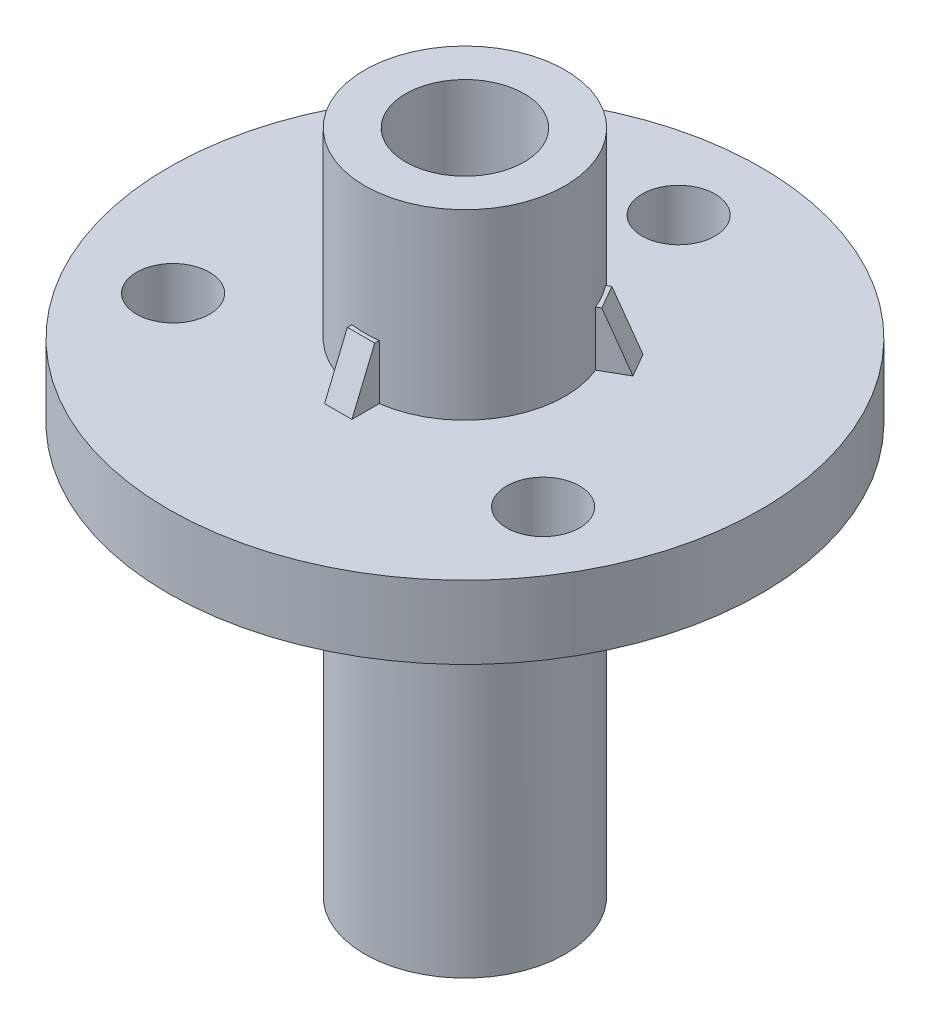
ISO-10303-21;
HEADER;
FILE_DESCRIPTION(('STEP AP214'),'2;1');
FILE_NAME('part.step','',(''),(''),'','','');
FILE_SCHEMA(('AUTOMOTIVE_DESIGN { 1 0 10303 214 1 1 1 1 }'));
ENDSEC;
DATA;
#1=APPLICATION_CONTEXT('core data for automotive mechanical design processes');
#2=APPLICATION_PROTOCOL_DEFINITION('international standard','automotive_design',2000,#1);
#3=PRODUCT_CONTEXT('',#1,'mechanical');
#4=PRODUCT('Part','Part','',(#3));
#5=PRODUCT_RELATED_PRODUCT_CATEGORY('part','',(#4));
#6=PRODUCT_DEFINITION_FORMATION('','',#4);
#7=PRODUCT_DEFINITION_CONTEXT('part definition',#1,'design');
#8=PRODUCT_DEFINITION('design','',#6,#7);
#9=PRODUCT_DEFINITION_SHAPE('','',#8);
#10=(LENGTH_UNIT() NAMED_UNIT(*) SI_UNIT(.MILLI.,.METRE.));
#11=(NAMED_UNIT(*) PLANE_ANGLE_UNIT() SI_UNIT($,.RADIAN.));
#12=(NAMED_UNIT(*) SI_UNIT($,.STERADIAN.) SOLID_ANGLE_UNIT());
#13=UNCERTAINTY_MEASURE_WITH_UNIT(LENGTH_MEASURE(1.E-05),#10,'distance_accuracy_value','');
#14=(GEOMETRIC_REPRESENTATION_CONTEXT(3) GLOBAL_UNCERTAINTY_ASSIGNED_CONTEXT((#13)) GLOBAL_UNIT_ASSIGNED_CONTEXT((#10,
#11,#12)) REPRESENTATION_CONTEXT('',''));
#15=CARTESIAN_POINT('',(0.,0.,0.));
#16=DIRECTION('',(0.,0.,1.));
#17=DIRECTION('',(1.,0.,0.));
#18=AXIS2_PLACEMENT_3D('',#15,#16,#17);
#19=CARTESIAN_POINT('',(0.,2.032,0.));
#20=DIRECTION('',(0.,1.,0.));
#21=DIRECTION('',(0.,0.,1.));
#22=AXIS2_PLACEMENT_3D('',#19,#20,#21);
#23=PLANE('',#22);
#24=CARTESIAN_POINT('',(10.3111149638085,2.032,5.9531249999999));
#25=DIRECTION('',(0.,1.,0.));
#26=DIRECTION('',(-0.866025403784443,0.,-0.499999999999992));
#27=AXIS2_PLACEMENT_3D('',#24,#25,#26);
#28=CIRCLE('',#27,2.032);
#29=CARTESIAN_POINT('',(8.55135134331854,2.032,4.93712499999992));
#30=VERTEX_POINT('',#29);
#31=EDGE_CURVE('E254',#30,#30,#28,.T.);
#32=ORIENTED_EDGE('',*,*,#31,.F.);
#33=EDGE_LOOP('',(#32));
#34=FACE_BOUND('',#33,.T.);
#35=CARTESIAN_POINT('',(-10.3111149638084,2.032,5.95312500000005));
#36=DIRECTION('',(0.,1.,0.));
#37=DIRECTION('',(0.866025403784436,0.,-0.500000000000004));
#38=AXIS2_PLACEMENT_3D('',#35,#36,#37);
#39=CIRCLE('',#38,2.032);
#40=CARTESIAN_POINT('',(-8.55135134331847,2.032,4.93712500000004));
#41=VERTEX_POINT('',#40);
#42=EDGE_CURVE('E245',#41,#41,#39,.T.);
#43=ORIENTED_EDGE('',*,*,#42,.F.);
#44=EDGE_LOOP('',(#43));
#45=FACE_BOUND('',#44,.T.);
#46=CARTESIAN_POINT('',(0.,2.032,-11.90625));
#47=DIRECTION('',(0.,1.,0.));
#48=DIRECTION('',(0.,0.,1.));
#49=AXIS2_PLACEMENT_3D('',#46,#47,#48);
#50=CIRCLE('',#49,2.032);
#51=CARTESIAN_POINT('',(0.,2.032,-9.87425));
#52=VERTEX_POINT('',#51);
#53=EDGE_CURVE('E242',#52,#52,#50,.T.);
#54=ORIENTED_EDGE('',*,*,#53,.F.);
#55=EDGE_LOOP('',(#54));
#56=FACE_BOUND('',#55,.T.);
#57=CARTESIAN_POINT('',(0.,2.032,0.));
#58=DIRECTION('',(0.,1.,0.));
#59=DIRECTION('',(0.,0.,1.));
#60=AXIS2_PLACEMENT_3D('',#57,#58,#59);
#61=CIRCLE('',#60,16.51);
#62=CARTESIAN_POINT('',(0.,2.032,16.51));
#63=VERTEX_POINT('',#62);
#64=EDGE_CURVE('E208',#63,#63,#61,.T.);
#65=ORIENTED_EDGE('',*,*,#64,.T.);
#66=EDGE_LOOP('',(#65));
#67=FACE_BOUND('',#66,.T.);
#68=CARTESIAN_POINT('',(0.,2.032,0.));
#69=DIRECTION('',(0.,1.,0.));
#70=DIRECTION('',(0.,0.,1.));
#71=AXIS2_PLACEMENT_3D('',#68,#69,#70);
#72=CIRCLE('',#71,5.588);
#73=CARTESIAN_POINT('',(4.41314486639695,2.032,-3.42781218683204));
#74=VERTEX_POINT('',#73);
#75=CARTESIAN_POINT('',(-4.41314486639691,2.032,-3.42781218683209));
#76=VERTEX_POINT('',#75);
#77=EDGE_CURVE('E207',#74,#76,#72,.T.);
#78=ORIENTED_EDGE('',*,*,#77,.F.);
#79=DIRECTION('',(0.866025403784443,0.,-0.499999999999993));
#80=VECTOR('',#79,1.);
#81=CARTESIAN_POINT('',(-0.380999999999991,2.032,-0.659911357683739));
#82=LINE('',#81,#80);
#83=CARTESIAN_POINT('',(5.73296758176445,2.032,-4.18981218683202));
#84=VERTEX_POINT('',#83);
#85=EDGE_CURVE('E158',#74,#84,#82,.T.);
#86=ORIENTED_EDGE('',*,*,#85,.T.);
#87=DIRECTION('',(0.499999999999992,0.,0.866025403784443));
#88=VECTOR('',#87,1.);
#89=CARTESIAN_POINT('',(6.11396758176444,2.032,-3.52990082914827));
#90=LINE('',#89,#88);
#91=CARTESIAN_POINT('',(6.49496758176444,2.032,-2.86998947146453));
#92=VERTEX_POINT('',#91);
#93=EDGE_CURVE('E144',#84,#92,#90,.T.);
#94=ORIENTED_EDGE('',*,*,#93,.T.);
#95=DIRECTION('',(-0.866025403784443,0.,0.499999999999993));
#96=VECTOR('',#95,1.);
#97=CARTESIAN_POINT('',(0.380999999999998,2.032,0.659911357683751));
#98=LINE('',#97,#96);
#99=CARTESIAN_POINT('',(5.17514486639695,2.032,-2.10798947146454));
#100=VERTEX_POINT('',#99);
#101=EDGE_CURVE('E156',#92,#100,#98,.T.);
#102=ORIENTED_EDGE('',*,*,#101,.T.);
#103=CARTESIAN_POINT('',(0.762,2.032,5.53580165829666));
#104=VERTEX_POINT('',#103);
#105=EDGE_CURVE('E130',#104,#100,#72,.T.);
#106=ORIENTED_EDGE('',*,*,#105,.F.);
#107=DIRECTION('',(0.,0.,1.));
#108=VECTOR('',#107,1.);
#109=CARTESIAN_POINT('',(0.761999999999993,2.032,0.));
#110=LINE('',#109,#108);
#111=CARTESIAN_POINT('',(0.762000000000001,2.032,7.05980165829666));
#112=VERTEX_POINT('',#111);
#113=EDGE_CURVE('E189',#104,#112,#110,.T.);
#114=ORIENTED_EDGE('',*,*,#113,.T.);
#115=DIRECTION('',(-1.,0.,0.));
#116=VECTOR('',#115,1.);
#117=CARTESIAN_POINT('',(0.,2.032,7.05980165829666));
#118=LINE('',#117,#116);
#119=CARTESIAN_POINT('',(-0.761999999999999,2.032,7.05980165829666));
#120=VERTEX_POINT('',#119);
#121=EDGE_CURVE('E219',#112,#120,#118,.T.);
#122=ORIENTED_EDGE('',*,*,#121,.T.);
#123=DIRECTION('',(0.,0.,-1.));
#124=VECTOR('',#123,1.);
#125=CARTESIAN_POINT('',(-0.762000000000007,2.032,0.));
#126=LINE('',#125,#124);
#127=CARTESIAN_POINT('',(-0.762000000000001,2.032,5.53580165829666));
#128=VERTEX_POINT('',#127);
#129=EDGE_CURVE('E186',#120,#128,#126,.T.);
#130=ORIENTED_EDGE('',*,*,#129,.T.);
#131=CARTESIAN_POINT('',(-5.17514486639692,2.032,-2.10798947146461));
#132=VERTEX_POINT('',#131);
#133=EDGE_CURVE('E201',#132,#128,#72,.T.);
#134=ORIENTED_EDGE('',*,*,#133,.F.);
#135=DIRECTION('',(-0.866025403784437,0.,-0.500000000000003));
#136=VECTOR('',#135,1.);
#137=CARTESIAN_POINT('',(-0.380999999999999,2.032,0.659911357683735));
#138=LINE('',#137,#136);
#139=CARTESIAN_POINT('',(-6.4949675817644,2.032,-2.86998947146462));
#140=VERTEX_POINT('',#139);
#141=EDGE_CURVE('E174',#132,#140,#138,.T.);
#142=ORIENTED_EDGE('',*,*,#141,.T.);
#143=DIRECTION('',(0.500000000000004,0.,-0.866025403784436));
#144=VECTOR('',#143,1.);
#145=CARTESIAN_POINT('',(-6.1139675817644,2.032,-3.52990082914836));
#146=LINE('',#145,#144);
#147=CARTESIAN_POINT('',(-5.73296758176439,2.032,-4.1898121868321));
#148=VERTEX_POINT('',#147);
#149=EDGE_CURVE('E145',#140,#148,#146,.T.);
#150=ORIENTED_EDGE('',*,*,#149,.T.);
#151=DIRECTION('',(0.866025403784437,0.,0.500000000000003));
#152=VECTOR('',#151,1.);
#153=CARTESIAN_POINT('',(0.381000000000006,2.032,-0.659911357683747));
#154=LINE('',#153,#152);
#155=EDGE_CURVE('E171',#148,#76,#154,.T.);
#156=ORIENTED_EDGE('',*,*,#155,.T.);
#157=EDGE_LOOP('',(#78,#86,#94,#102,#106,#114,#122,#130,#134,#142,#150,#156));
#158=FACE_BOUND('',#157,.T.);
#159=ADVANCED_FACE('F32',(#34,#45,#56,#67,#158),#23,.T.);
#160=CARTESIAN_POINT('',(0.,12.192,0.));
#161=DIRECTION('',(0.,-1.,0.));
#162=DIRECTION('',(0.,0.,-1.));
#163=AXIS2_PLACEMENT_3D('',#160,#161,#162);
#164=CYLINDRICAL_SURFACE('',#163,5.588);
#165=CARTESIAN_POINT('',(0.,12.192,0.));
#166=DIRECTION('',(0.,1.,0.));
#167=DIRECTION('',(0.,0.,1.));
#168=AXIS2_PLACEMENT_3D('',#165,#166,#167);
#169=CIRCLE('',#168,5.588);
#170=CARTESIAN_POINT('',(0.,12.192,5.588));
#171=VERTEX_POINT('',#170);
#172=EDGE_CURVE('E202',#171,#171,#169,.T.);
#173=ORIENTED_EDGE('',*,*,#172,.F.);
#174=EDGE_LOOP('',(#173));
#175=FACE_BOUND('',#174,.T.);
#176=DIRECTION('',(0.,-1.,0.));
#177=VECTOR('',#176,1.);
#178=CARTESIAN_POINT('',(4.41314486639696,5.08,-3.42781218683203));
#179=LINE('',#178,#177);
#180=CARTESIAN_POINT('',(4.41314486639695,5.08,-3.42781218683204));
#181=VERTEX_POINT('',#180);
#182=EDGE_CURVE('E134',#181,#74,#179,.T.);
#183=ORIENTED_EDGE('',*,*,#182,.T.);
#184=ORIENTED_EDGE('',*,*,#77,.T.);
#185=DIRECTION('',(0.,-1.,0.));
#186=VECTOR('',#185,1.);
#187=CARTESIAN_POINT('',(-4.41314486639691,5.08,-3.42781218683209));
#188=LINE('',#187,#186);
#189=CARTESIAN_POINT('',(-4.41314486639691,5.08,-3.42781218683209));
#190=VERTEX_POINT('',#189);
#191=EDGE_CURVE('E166',#190,#76,#188,.T.);
#192=ORIENTED_EDGE('',*,*,#191,.F.);
#193=CARTESIAN_POINT('',(0.,5.08,0.));
#194=DIRECTION('',(0.,-1.,0.));
#195=DIRECTION('',(0.,0.,-1.));
#196=AXIS2_PLACEMENT_3D('',#193,#194,#195);
#197=CIRCLE('',#196,5.588);
#198=CARTESIAN_POINT('',(-5.17514486639691,5.08,-2.10798947146462));
#199=VERTEX_POINT('',#198);
#200=EDGE_CURVE('E221',#199,#190,#197,.T.);
#201=ORIENTED_EDGE('',*,*,#200,.F.);
#202=DIRECTION('',(0.,-1.,0.));
#203=VECTOR('',#202,1.);
#204=CARTESIAN_POINT('',(-5.17514486639692,5.08,-2.10798947146461));
#205=LINE('',#204,#203);
#206=EDGE_CURVE('E169',#199,#132,#205,.T.);
#207=ORIENTED_EDGE('',*,*,#206,.T.);
#208=ORIENTED_EDGE('',*,*,#133,.T.);
#209=DIRECTION('',(0.,-1.,0.));
#210=VECTOR('',#209,1.);
#211=CARTESIAN_POINT('',(-0.762000000000001,5.08,5.53580165829666));
#212=LINE('',#211,#210);
#213=CARTESIAN_POINT('',(-0.762000000000001,5.08,5.53580165829666));
#214=VERTEX_POINT('',#213);
#215=EDGE_CURVE('E181',#214,#128,#212,.T.);
#216=ORIENTED_EDGE('',*,*,#215,.F.);
#217=CARTESIAN_POINT('',(0.,5.08,0.));
#218=DIRECTION('',(0.,-1.,0.));
#219=DIRECTION('',(0.,0.,-1.));
#220=AXIS2_PLACEMENT_3D('',#217,#218,#219);
#221=CIRCLE('',#220,5.588);
#222=CARTESIAN_POINT('',(0.762000000000004,5.08,5.53580165829665));
#223=VERTEX_POINT('',#222);
#224=EDGE_CURVE('E216',#223,#214,#221,.T.);
#225=ORIENTED_EDGE('',*,*,#224,.F.);
#226=DIRECTION('',(0.,-1.,0.));
#227=VECTOR('',#226,1.);
#228=CARTESIAN_POINT('',(0.761999999999999,5.08,5.53580165829666));
#229=LINE('',#228,#227);
#230=EDGE_CURVE('E184',#223,#104,#229,.T.);
#231=ORIENTED_EDGE('',*,*,#230,.T.);
#232=ORIENTED_EDGE('',*,*,#105,.T.);
#233=DIRECTION('',(0.,-1.,0.));
#234=VECTOR('',#233,1.);
#235=CARTESIAN_POINT('',(5.17514486639695,5.08,-2.10798947146454));
#236=LINE('',#235,#234);
#237=CARTESIAN_POINT('',(5.17514486639695,5.08,-2.10798947146454));
#238=VERTEX_POINT('',#237);
#239=EDGE_CURVE('E124',#238,#100,#236,.T.);
#240=ORIENTED_EDGE('',*,*,#239,.F.);
#241=CARTESIAN_POINT('',(0.,5.08,0.));
#242=DIRECTION('',(0.,-1.,0.));
#243=DIRECTION('',(0.,0.,-1.));
#244=AXIS2_PLACEMENT_3D('',#241,#242,#243);
#245=CIRCLE('',#244,5.588);
#246=EDGE_CURVE('E127',#181,#238,#245,.T.);
#247=ORIENTED_EDGE('',*,*,#246,.F.);
#248=EDGE_LOOP('',(#183,#184,#192,#201,#207,#208,#216,#225,#231,#232,#240,#247));
#249=FACE_BOUND('',#248,.T.);
#250=ADVANCED_FACE('F126',(#175,#249),#164,.T.);
#251=CARTESIAN_POINT('',(0.,-2.032,0.));
#252=DIRECTION('',(0.,1.,0.));
#253=DIRECTION('',(0.,0.,1.));
#254=AXIS2_PLACEMENT_3D('',#251,#252,#253);
#255=PLANE('',#254);
#256=CARTESIAN_POINT('',(10.3111149638085,-2.032,5.9531249999999));
#257=DIRECTION('',(0.,1.,0.));
#258=DIRECTION('',(0.,0.,1.));
#259=AXIS2_PLACEMENT_3D('',#256,#257,#258);
#260=CIRCLE('',#259,2.032);
#261=CARTESIAN_POINT('',(10.3111149638085,-2.032,7.98512499999991));
#262=VERTEX_POINT('',#261);
#263=EDGE_CURVE('E36',#262,#262,#260,.T.);
#264=ORIENTED_EDGE('',*,*,#263,.T.);
#265=EDGE_LOOP('',(#264));
#266=FACE_BOUND('',#265,.T.);
#267=CARTESIAN_POINT('',(-10.3111149638084,-2.032,5.95312500000005));
#268=DIRECTION('',(0.,1.,0.));
#269=DIRECTION('',(0.,0.,1.));
#270=AXIS2_PLACEMENT_3D('',#267,#268,#269);
#271=CIRCLE('',#270,2.032);
#272=CARTESIAN_POINT('',(-10.3111149638084,-2.032,7.98512500000005));
#273=VERTEX_POINT('',#272);
#274=EDGE_CURVE('E243',#273,#273,#271,.T.);
#275=ORIENTED_EDGE('',*,*,#274,.T.);
#276=EDGE_LOOP('',(#275));
#277=FACE_BOUND('',#276,.T.);
#278=CARTESIAN_POINT('',(0.,-2.032,-11.90625));
#279=DIRECTION('',(0.,1.,0.));
#280=DIRECTION('',(0.,0.,1.));
#281=AXIS2_PLACEMENT_3D('',#278,#279,#280);
#282=CIRCLE('',#281,2.032);
#283=CARTESIAN_POINT('',(0.,-2.032,-9.87425));
#284=VERTEX_POINT('',#283);
#285=EDGE_CURVE('E151',#284,#284,#282,.T.);
#286=ORIENTED_EDGE('',*,*,#285,.T.);
#287=EDGE_LOOP('',(#286));
#288=FACE_BOUND('',#287,.T.);
#289=CARTESIAN_POINT('',(0.,-2.032,0.));
#290=DIRECTION('',(0.,1.,0.));
#291=DIRECTION('',(0.,0.,1.));
#292=AXIS2_PLACEMENT_3D('',#289,#290,#291);
#293=CIRCLE('',#292,16.51);
#294=CARTESIAN_POINT('',(0.,-2.032,16.51));
#295=VERTEX_POINT('',#294);
#296=EDGE_CURVE('E205',#295,#295,#293,.T.);
#297=ORIENTED_EDGE('',*,*,#296,.F.);
#298=EDGE_LOOP('',(#297));
#299=FACE_BOUND('',#298,.T.);
#300=CARTESIAN_POINT('',(0.,-2.032,0.));
#301=DIRECTION('',(0.,1.,0.));
#302=DIRECTION('',(0.,0.,1.));
#303=AXIS2_PLACEMENT_3D('',#300,#301,#302);
#304=CIRCLE('',#303,5.588);
#305=CARTESIAN_POINT('',(0.,-2.032,5.588));
#306=VERTEX_POINT('',#305);
#307=EDGE_CURVE('E211',#306,#306,#304,.F.);
#308=ORIENTED_EDGE('',*,*,#307,.F.);
#309=EDGE_LOOP('',(#308));
#310=FACE_BOUND('',#309,.T.);
#311=ADVANCED_FACE('F339',(#266,#277,#288,#299,#310),#255,.F.);
#312=CARTESIAN_POINT('',(0.,2.032,0.));
#313=DIRECTION('',(0.,-1.,0.));
#314=DIRECTION('',(0.,0.,-1.));
#315=AXIS2_PLACEMENT_3D('',#312,#313,#314);
#316=CYLINDRICAL_SURFACE('',#315,16.51);
#317=ORIENTED_EDGE('',*,*,#64,.F.);
#318=EDGE_LOOP('',(#317));
#319=FACE_BOUND('',#318,.T.);
#320=ORIENTED_EDGE('',*,*,#296,.T.);
#321=EDGE_LOOP('',(#320));
#322=FACE_BOUND('',#321,.T.);
#323=ADVANCED_FACE('F336',(#319,#322),#316,.T.);
#324=CARTESIAN_POINT('',(0.,12.192,0.));
#325=DIRECTION('',(0.,1.,0.));
#326=DIRECTION('',(0.,0.,1.));
#327=AXIS2_PLACEMENT_3D('',#324,#325,#326);
#328=PLANE('',#327);
#329=CARTESIAN_POINT('',(0.,12.192,0.));
#330=DIRECTION('',(0.,1.,0.));
#331=DIRECTION('',(0.,0.,1.));
#332=AXIS2_PLACEMENT_3D('',#329,#330,#331);
#333=CIRCLE('',#332,3.302);
#334=CARTESIAN_POINT('',(0.,12.192,3.302));
#335=VERTEX_POINT('',#334);
#336=EDGE_CURVE('E192',#335,#335,#333,.T.);
#337=ORIENTED_EDGE('',*,*,#336,.F.);
#338=EDGE_LOOP('',(#337));
#339=FACE_BOUND('',#338,.T.);
#340=ORIENTED_EDGE('',*,*,#172,.T.);
#341=EDGE_LOOP('',(#340));
#342=FACE_BOUND('',#341,.T.);
#343=ADVANCED_FACE('F332',(#339,#342),#328,.T.);
#344=CARTESIAN_POINT('',(0.,-24.892,0.));
#345=DIRECTION('',(0.,1.,0.));
#346=DIRECTION('',(0.,0.,1.));
#347=AXIS2_PLACEMENT_3D('',#344,#345,#346);
#348=CYLINDRICAL_SURFACE('',#347,5.588);
#349=CARTESIAN_POINT('',(0.,-24.892,0.));
#350=DIRECTION('',(0.,-1.,0.));
#351=DIRECTION('',(0.,0.,-1.));
#352=AXIS2_PLACEMENT_3D('',#349,#350,#351);
#353=CIRCLE('',#352,5.588);
#354=CARTESIAN_POINT('',(0.,-24.892,-5.588));
#355=VERTEX_POINT('',#354);
#356=EDGE_CURVE('E196',#355,#355,#353,.T.);
#357=ORIENTED_EDGE('',*,*,#356,.F.);
#358=EDGE_LOOP('',(#357));
#359=FACE_BOUND('',#358,.T.);
#360=ORIENTED_EDGE('',*,*,#307,.T.);
#361=EDGE_LOOP('',(#360));
#362=FACE_BOUND('',#361,.T.);
#363=ADVANCED_FACE('F328',(#359,#362),#348,.T.);
#364=CARTESIAN_POINT('',(0.,-24.892,0.));
#365=DIRECTION('',(0.,-1.,0.));
#366=DIRECTION('',(0.,0.,-1.));
#367=AXIS2_PLACEMENT_3D('',#364,#365,#366);
#368=PLANE('',#367);
#369=CARTESIAN_POINT('',(0.,-24.892,0.));
#370=DIRECTION('',(0.,1.,0.));
#371=DIRECTION('',(0.,0.,1.));
#372=AXIS2_PLACEMENT_3D('',#369,#370,#371);
#373=CIRCLE('',#372,3.302);
#374=CARTESIAN_POINT('',(0.,-24.892,3.302));
#375=VERTEX_POINT('',#374);
#376=EDGE_CURVE('E193',#375,#375,#373,.T.);
#377=ORIENTED_EDGE('',*,*,#376,.T.);
#378=EDGE_LOOP('',(#377));
#379=FACE_BOUND('',#378,.T.);
#380=ORIENTED_EDGE('',*,*,#356,.T.);
#381=EDGE_LOOP('',(#380));
#382=FACE_BOUND('',#381,.T.);
#383=ADVANCED_FACE('F324',(#379,#382),#368,.T.);
#384=CARTESIAN_POINT('',(0.,-24.892,0.));
#385=DIRECTION('',(0.,1.,0.));
#386=DIRECTION('',(0.,0.,1.));
#387=AXIS2_PLACEMENT_3D('',#384,#385,#386);
#388=CYLINDRICAL_SURFACE('',#387,3.302);
#389=ORIENTED_EDGE('',*,*,#376,.F.);
#390=EDGE_LOOP('',(#389));
#391=FACE_BOUND('',#390,.T.);
#392=ORIENTED_EDGE('',*,*,#336,.T.);
#393=EDGE_LOOP('',(#392));
#394=FACE_BOUND('',#393,.T.);
#395=ADVANCED_FACE('F317',(#391,#394),#388,.F.);
#396=CARTESIAN_POINT('',(0.761999999999999,5.08,5.53580165829666));
#397=DIRECTION('',(0.,-1.,0.));
#398=DIRECTION('',(0.,0.,-1.));
#399=AXIS2_PLACEMENT_3D('',#396,#397,#398);
#400=PLANE('',#399);
#401=DIRECTION('',(0.,0.,1.));
#402=VECTOR('',#401,1.);
#403=CARTESIAN_POINT('',(-0.761999999999999,5.08,7.05980165829666));
#404=LINE('',#403,#402);
#405=CARTESIAN_POINT('',(-0.762000000000001,5.08,5.78980165829666));
#406=VERTEX_POINT('',#405);
#407=EDGE_CURVE('E179',#214,#406,#404,.T.);
#408=ORIENTED_EDGE('',*,*,#407,.T.);
#409=DIRECTION('',(1.,0.,0.));
#410=VECTOR('',#409,1.);
#411=CARTESIAN_POINT('',(0.761999999999999,5.08,5.78980165829666));
#412=LINE('',#411,#410);
#413=CARTESIAN_POINT('',(0.761999999999999,5.08,5.78980165829666));
#414=VERTEX_POINT('',#413);
#415=EDGE_CURVE('E238',#406,#414,#412,.T.);
#416=ORIENTED_EDGE('',*,*,#415,.T.);
#417=DIRECTION('',(0.,0.,-1.));
#418=VECTOR('',#417,1.);
#419=CARTESIAN_POINT('',(0.762000000000001,5.08,7.05980165829666));
#420=LINE('',#419,#418);
#421=EDGE_CURVE('E177',#414,#223,#420,.T.);
#422=ORIENTED_EDGE('',*,*,#421,.T.);
#423=ORIENTED_EDGE('',*,*,#224,.T.);
#424=EDGE_LOOP('',(#408,#416,#422,#423));
#425=FACE_BOUND('',#424,.T.);
#426=ADVANCED_FACE('F285',(#425),#400,.F.);
#427=CARTESIAN_POINT('',(0.762000000000001,5.08,7.05980165829666));
#428=DIRECTION('',(-1.,0.,0.));
#429=DIRECTION('',(0.,0.,1.));
#430=AXIS2_PLACEMENT_3D('',#427,#428,#429);
#431=PLANE('',#430);
#432=ORIENTED_EDGE('',*,*,#421,.F.);
#433=DIRECTION('',(0.,0.923076923076924,-0.384615384615382));
#434=VECTOR('',#433,1.);
#435=CARTESIAN_POINT('',(0.761999999999999,5.08,5.78980165829666));
#436=LINE('',#435,#434);
#437=EDGE_CURVE('E41',#414,#112,#436,.F.);
#438=ORIENTED_EDGE('',*,*,#437,.T.);
#439=ORIENTED_EDGE('',*,*,#113,.F.);
#440=ORIENTED_EDGE('',*,*,#230,.F.);
#441=EDGE_LOOP('',(#432,#438,#439,#440));
#442=FACE_BOUND('',#441,.T.);
#443=ADVANCED_FACE('F282',(#442),#431,.F.);
#444=CARTESIAN_POINT('',(-0.761999999999999,5.08,7.05980165829666));
#445=DIRECTION('',(1.,0.,0.));
#446=DIRECTION('',(0.,0.,-1.));
#447=AXIS2_PLACEMENT_3D('',#444,#445,#446);
#448=PLANE('',#447);
#449=ORIENTED_EDGE('',*,*,#129,.F.);
#450=DIRECTION('',(0.,-0.923076923076924,0.384615384615382));
#451=VECTOR('',#450,1.);
#452=CARTESIAN_POINT('',(-0.762000000000001,5.08,5.78980165829666));
#453=LINE('',#452,#451);
#454=EDGE_CURVE('E11',#120,#406,#453,.F.);
#455=ORIENTED_EDGE('',*,*,#454,.T.);
#456=ORIENTED_EDGE('',*,*,#407,.F.);
#457=ORIENTED_EDGE('',*,*,#215,.T.);
#458=EDGE_LOOP('',(#449,#455,#456,#457));
#459=FACE_BOUND('',#458,.T.);
#460=ADVANCED_FACE('F287',(#459),#448,.F.);
#461=CARTESIAN_POINT('',(-5.17514486639692,5.08,-2.10798947146461));
#462=DIRECTION('',(0.,-1.,0.));
#463=DIRECTION('',(0.866025403784436,0.,0.500000000000004));
#464=AXIS2_PLACEMENT_3D('',#461,#462,#463);
#465=PLANE('',#464);
#466=DIRECTION('',(-0.866025403784437,0.,-0.500000000000003));
#467=VECTOR('',#466,1.);
#468=CARTESIAN_POINT('',(-5.73296758176439,5.08,-4.1898121868321));
#469=LINE('',#468,#467);
#470=CARTESIAN_POINT('',(-4.63311531895815,5.08,-3.55481218683209));
#471=VERTEX_POINT('',#470);
#472=EDGE_CURVE('E163',#190,#471,#469,.T.);
#473=ORIENTED_EDGE('',*,*,#472,.T.);
#474=DIRECTION('',(-0.500000000000004,0.,0.866025403784436));
#475=VECTOR('',#474,1.);
#476=CARTESIAN_POINT('',(-5.39511531895815,5.08,-2.23498947146461));
#477=LINE('',#476,#475);
#478=CARTESIAN_POINT('',(-5.39511531895815,5.08,-2.23498947146461));
#479=VERTEX_POINT('',#478);
#480=EDGE_CURVE('E231',#471,#479,#477,.T.);
#481=ORIENTED_EDGE('',*,*,#480,.T.);
#482=DIRECTION('',(0.866025403784437,0.,0.500000000000003));
#483=VECTOR('',#482,1.);
#484=CARTESIAN_POINT('',(-6.4949675817644,5.08,-2.86998947146462));
#485=LINE('',#484,#483);
#486=EDGE_CURVE('E161',#479,#199,#485,.T.);
#487=ORIENTED_EDGE('',*,*,#486,.T.);
#488=ORIENTED_EDGE('',*,*,#200,.T.);
#489=EDGE_LOOP('',(#473,#481,#487,#488));
#490=FACE_BOUND('',#489,.T.);
#491=ADVANCED_FACE('F299',(#490),#465,.F.);
#492=CARTESIAN_POINT('',(-6.4949675817644,5.08,-2.86998947146462));
#493=DIRECTION('',(0.500000000000003,0.,-0.866025403784437));
#494=DIRECTION('',(-0.866025403784437,0.,-0.500000000000003));
#495=AXIS2_PLACEMENT_3D('',#492,#493,#494);
#496=PLANE('',#495);
#497=ORIENTED_EDGE('',*,*,#486,.F.);
#498=DIRECTION('',(0.333086693763243,0.923076923076924,0.192307692307692));
#499=VECTOR('',#498,1.);
#500=CARTESIAN_POINT('',(-5.39511531895815,5.08,-2.23498947146461));
#501=LINE('',#500,#499);
#502=EDGE_CURVE('E234',#479,#140,#501,.F.);
#503=ORIENTED_EDGE('',*,*,#502,.T.);
#504=ORIENTED_EDGE('',*,*,#141,.F.);
#505=ORIENTED_EDGE('',*,*,#206,.F.);
#506=EDGE_LOOP('',(#497,#503,#504,#505));
#507=FACE_BOUND('',#506,.T.);
#508=ADVANCED_FACE('F293',(#507),#496,.F.);
#509=CARTESIAN_POINT('',(-5.73296758176439,5.08,-4.1898121868321));
#510=DIRECTION('',(-0.500000000000003,0.,0.866025403784437));
#511=DIRECTION('',(0.866025403784437,0.,0.500000000000003));
#512=AXIS2_PLACEMENT_3D('',#509,#510,#511);
#513=PLANE('',#512);
#514=ORIENTED_EDGE('',*,*,#155,.F.);
#515=DIRECTION('',(-0.333086693763243,-0.923076923076924,-0.192307692307692));
#516=VECTOR('',#515,1.);
#517=CARTESIAN_POINT('',(-4.63311531895815,5.08,-3.55481218683209));
#518=LINE('',#517,#516);
#519=EDGE_CURVE('E236',#148,#471,#518,.F.);
#520=ORIENTED_EDGE('',*,*,#519,.T.);
#521=ORIENTED_EDGE('',*,*,#472,.F.);
#522=ORIENTED_EDGE('',*,*,#191,.T.);
#523=EDGE_LOOP('',(#514,#520,#521,#522));
#524=FACE_BOUND('',#523,.T.);
#525=ADVANCED_FACE('F303',(#524),#513,.F.);
#526=CARTESIAN_POINT('',(4.41314486639696,5.08,-3.42781218683203));
#527=DIRECTION('',(0.,-1.,0.));
#528=DIRECTION('',(-0.866025403784443,0.,0.499999999999992));
#529=AXIS2_PLACEMENT_3D('',#526,#527,#528);
#530=PLANE('',#529);
#531=DIRECTION('',(0.866025403784443,0.,-0.499999999999993));
#532=VECTOR('',#531,1.);
#533=CARTESIAN_POINT('',(6.49496758176444,5.08,-2.86998947146453));
#534=LINE('',#533,#532);
#535=CARTESIAN_POINT('',(5.39511531895819,5.08,-2.23498947146453));
#536=VERTEX_POINT('',#535);
#537=EDGE_CURVE('E135',#238,#536,#534,.T.);
#538=ORIENTED_EDGE('',*,*,#537,.T.);
#539=DIRECTION('',(-0.499999999999992,0.,-0.866025403784443));
#540=VECTOR('',#539,1.);
#541=CARTESIAN_POINT('',(4.6331153189582,5.08,-3.55481218683202));
#542=LINE('',#541,#540);
#543=CARTESIAN_POINT('',(4.6331153189582,5.08,-3.55481218683203));
#544=VERTEX_POINT('',#543);
#545=EDGE_CURVE('E226',#536,#544,#542,.T.);
#546=ORIENTED_EDGE('',*,*,#545,.T.);
#547=DIRECTION('',(-0.866025403784443,0.,0.499999999999993));
#548=VECTOR('',#547,1.);
#549=CARTESIAN_POINT('',(5.73296758176445,5.08,-4.18981218683202));
#550=LINE('',#549,#548);
#551=EDGE_CURVE('E143',#544,#181,#550,.T.);
#552=ORIENTED_EDGE('',*,*,#551,.T.);
#553=ORIENTED_EDGE('',*,*,#246,.T.);
#554=EDGE_LOOP('',(#538,#546,#552,#553));
#555=FACE_BOUND('',#554,.T.);
#556=ADVANCED_FACE('F139',(#555),#530,.F.);
#557=CARTESIAN_POINT('',(5.73296758176445,5.08,-4.18981218683202));
#558=DIRECTION('',(0.499999999999993,0.,0.866025403784443));
#559=DIRECTION('',(0.866025403784443,0.,-0.499999999999993));
#560=AXIS2_PLACEMENT_3D('',#557,#558,#559);
#561=PLANE('',#560);
#562=ORIENTED_EDGE('',*,*,#551,.F.);
#563=DIRECTION('',(-0.333086693763245,0.923076923076924,0.192307692307688));
#564=VECTOR('',#563,1.);
#565=CARTESIAN_POINT('',(4.6331153189582,5.08,-3.55481218683203));
#566=LINE('',#565,#564);
#567=EDGE_CURVE('E228',#544,#84,#566,.F.);
#568=ORIENTED_EDGE('',*,*,#567,.T.);
#569=ORIENTED_EDGE('',*,*,#85,.F.);
#570=ORIENTED_EDGE('',*,*,#182,.F.);
#571=EDGE_LOOP('',(#562,#568,#569,#570));
#572=FACE_BOUND('',#571,.T.);
#573=ADVANCED_FACE('F275',(#572),#561,.F.);
#574=CARTESIAN_POINT('',(6.49496758176444,5.08,-2.86998947146453));
#575=DIRECTION('',(-0.499999999999993,0.,-0.866025403784443));
#576=DIRECTION('',(-0.866025403784443,0.,0.499999999999993));
#577=AXIS2_PLACEMENT_3D('',#574,#575,#576);
#578=PLANE('',#577);
#579=ORIENTED_EDGE('',*,*,#101,.F.);
#580=DIRECTION('',(0.333086693763245,-0.923076923076924,-0.192307692307688));
#581=VECTOR('',#580,1.);
#582=CARTESIAN_POINT('',(5.39511531895819,5.08,-2.23498947146453));
#583=LINE('',#582,#581);
#584=EDGE_CURVE('E149',#92,#536,#583,.F.);
#585=ORIENTED_EDGE('',*,*,#584,.T.);
#586=ORIENTED_EDGE('',*,*,#537,.F.);
#587=ORIENTED_EDGE('',*,*,#239,.T.);
#588=EDGE_LOOP('',(#579,#585,#586,#587));
#589=FACE_BOUND('',#588,.T.);
#590=ADVANCED_FACE('F147',(#589),#578,.F.);
#591=CARTESIAN_POINT('',(4.63311531895821,5.08,-3.55481218683202));
#592=DIRECTION('',(-0.799408065031795,-0.384615384615382,0.461538461538455));
#593=DIRECTION('',(0.499999999999992,0.,0.866025403784443));
#594=AXIS2_PLACEMENT_3D('',#591,#592,#593);
#595=PLANE('',#594);
#596=ORIENTED_EDGE('',*,*,#584,.F.);
#597=ORIENTED_EDGE('',*,*,#93,.F.);
#598=ORIENTED_EDGE('',*,*,#567,.F.);
#599=ORIENTED_EDGE('',*,*,#545,.F.);
#600=EDGE_LOOP('',(#596,#597,#598,#599));
#601=FACE_BOUND('',#600,.T.);
#602=ADVANCED_FACE('F277',(#601),#595,.F.);
#603=CARTESIAN_POINT('',(-5.39511531895815,5.08,-2.23498947146461));
#604=DIRECTION('',(0.799408065031788,-0.384615384615383,0.461538461538466));
#605=DIRECTION('',(0.500000000000004,0.,-0.866025403784436));
#606=AXIS2_PLACEMENT_3D('',#603,#604,#605);
#607=PLANE('',#606);
#608=ORIENTED_EDGE('',*,*,#519,.F.);
#609=ORIENTED_EDGE('',*,*,#149,.F.);
#610=ORIENTED_EDGE('',*,*,#502,.F.);
#611=ORIENTED_EDGE('',*,*,#480,.F.);
#612=EDGE_LOOP('',(#608,#609,#610,#611));
#613=FACE_BOUND('',#612,.T.);
#614=ADVANCED_FACE('F297',(#613),#607,.F.);
#615=CARTESIAN_POINT('',(0.761999999999999,5.08,5.78980165829666));
#616=DIRECTION('',(0.,-0.384615384615382,-0.923076923076924));
#617=DIRECTION('',(0.,0.923076923076924,-0.384615384615382));
#618=AXIS2_PLACEMENT_3D('',#615,#616,#617);
#619=PLANE('',#618);
#620=ORIENTED_EDGE('',*,*,#454,.F.);
#621=ORIENTED_EDGE('',*,*,#121,.F.);
#622=ORIENTED_EDGE('',*,*,#437,.F.);
#623=ORIENTED_EDGE('',*,*,#415,.F.);
#624=EDGE_LOOP('',(#620,#621,#622,#623));
#625=FACE_BOUND('',#624,.T.);
#626=ADVANCED_FACE('F34',(#625),#619,.F.);
#627=CARTESIAN_POINT('',(0.,-24.892,-11.90625));
#628=DIRECTION('',(0.,1.,0.));
#629=DIRECTION('',(0.,0.,1.));
#630=AXIS2_PLACEMENT_3D('',#627,#628,#629);
#631=CYLINDRICAL_SURFACE('',#630,2.032);
#632=ORIENTED_EDGE('',*,*,#53,.T.);
#633=EDGE_LOOP('',(#632));
#634=FACE_BOUND('',#633,.T.);
#635=ORIENTED_EDGE('',*,*,#285,.F.);
#636=EDGE_LOOP('',(#635));
#637=FACE_BOUND('',#636,.T.);
#638=ADVANCED_FACE('F353',(#634,#637),#631,.F.);
#639=CARTESIAN_POINT('',(-10.3111149638084,-24.892,5.95312500000005));
#640=DIRECTION('',(0.,1.,0.));
#641=DIRECTION('',(0.,0.,1.));
#642=AXIS2_PLACEMENT_3D('',#639,#640,#641);
#643=CYLINDRICAL_SURFACE('',#642,2.032);
#644=ORIENTED_EDGE('',*,*,#42,.T.);
#645=EDGE_LOOP('',(#644));
#646=FACE_BOUND('',#645,.T.);
#647=ORIENTED_EDGE('',*,*,#274,.F.);
#648=EDGE_LOOP('',(#647));
#649=FACE_BOUND('',#648,.T.);
#650=ADVANCED_FACE('F357',(#646,#649),#643,.F.);
#651=CARTESIAN_POINT('',(10.3111149638085,-24.892,5.9531249999999));
#652=DIRECTION('',(0.,1.,0.));
#653=DIRECTION('',(0.,0.,1.));
#654=AXIS2_PLACEMENT_3D('',#651,#652,#653);
#655=CYLINDRICAL_SURFACE('',#654,2.032);
#656=ORIENTED_EDGE('',*,*,#31,.T.);
#657=EDGE_LOOP('',(#656));
#658=FACE_BOUND('',#657,.T.);
#659=ORIENTED_EDGE('',*,*,#263,.F.);
#660=EDGE_LOOP('',(#659));
#661=FACE_BOUND('',#660,.T.);
#662=ADVANCED_FACE('F259',(#658,#661),#655,.F.);
#663=CLOSED_SHELL('',(#159,#250,#311,#323,#343,#363,#383,#395,#426,#443,#460,#491,#508,#525,
#556,#573,#590,#602,#614,#626,#638,#650,#662));
#664=MANIFOLD_SOLID_BREP('B2',#663);
#665=ADVANCED_BREP_SHAPE_REPRESENTATION('',(#18,#664),#14);
#666=SHAPE_DEFINITION_REPRESENTATION(#9,#665);
ENDSEC;
END-ISO-10303-21;
